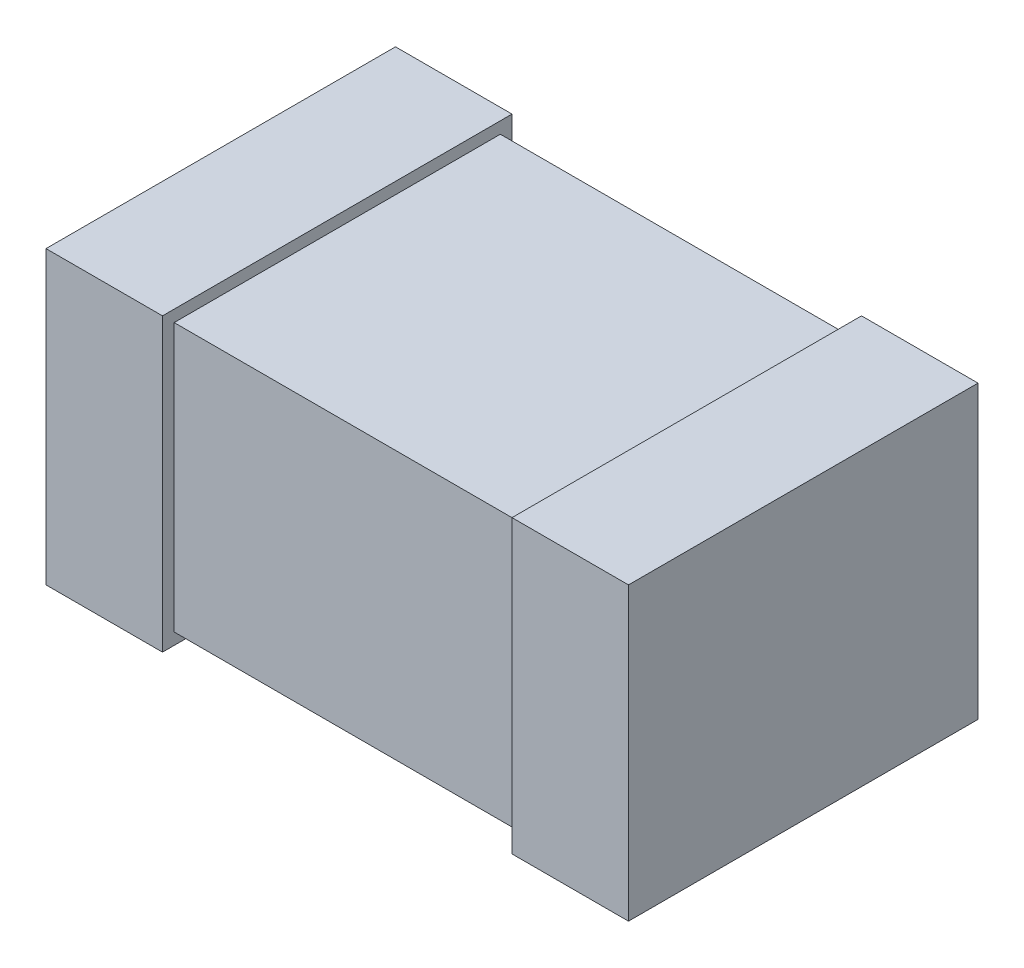
ISO-10303-21;
HEADER;
FILE_DESCRIPTION(('STEP AP214'),'2;1');
FILE_NAME('part.step','',(''),(''),'','','');
FILE_SCHEMA(('AUTOMOTIVE_DESIGN { 1 0 10303 214 1 1 1 1 }'));
ENDSEC;
DATA;
#1=APPLICATION_CONTEXT('core data for automotive mechanical design processes');
#2=APPLICATION_PROTOCOL_DEFINITION('international standard','automotive_design',2000,#1);
#3=PRODUCT_CONTEXT('',#1,'mechanical');
#4=PRODUCT('Part','Part','',(#3));
#5=PRODUCT_RELATED_PRODUCT_CATEGORY('part','',(#4));
#6=PRODUCT_DEFINITION_FORMATION('','',#4);
#7=PRODUCT_DEFINITION_CONTEXT('part definition',#1,'design');
#8=PRODUCT_DEFINITION('design','',#6,#7);
#9=PRODUCT_DEFINITION_SHAPE('','',#8);
#10=(LENGTH_UNIT() NAMED_UNIT(*) SI_UNIT(.MILLI.,.METRE.));
#11=(NAMED_UNIT(*) PLANE_ANGLE_UNIT() SI_UNIT($,.RADIAN.));
#12=(NAMED_UNIT(*) SI_UNIT($,.STERADIAN.) SOLID_ANGLE_UNIT());
#13=UNCERTAINTY_MEASURE_WITH_UNIT(LENGTH_MEASURE(1.E-05),#10,'distance_accuracy_value','');
#14=(GEOMETRIC_REPRESENTATION_CONTEXT(3) GLOBAL_UNCERTAINTY_ASSIGNED_CONTEXT((#13)) GLOBAL_UNIT_ASSIGNED_CONTEXT((#10,
#11,#12)) REPRESENTATION_CONTEXT('',''));
#15=CARTESIAN_POINT('',(0.,0.,0.));
#16=DIRECTION('',(0.,0.,1.));
#17=DIRECTION('',(1.,0.,0.));
#18=AXIS2_PLACEMENT_3D('',#15,#16,#17);
#19=CARTESIAN_POINT('',(-0.5,0.25,0.0762));
#20=DIRECTION('',(-1.,0.,0.));
#21=DIRECTION('',(0.,0.,1.));
#22=AXIS2_PLACEMENT_3D('',#19,#20,#21);
#23=PLANE('',#22);
#24=DIRECTION('',(0.,0.,1.));
#25=VECTOR('',#24,1.);
#26=CARTESIAN_POINT('',(-0.5,0.25,0.0762));
#27=LINE('',#26,#25);
#28=CARTESIAN_POINT('',(-0.5,0.25,0.0762));
#29=VERTEX_POINT('',#28);
#30=CARTESIAN_POINT('',(-0.5,0.25,0.6762));
#31=VERTEX_POINT('',#30);
#32=EDGE_CURVE('E118',#29,#31,#27,.T.);
#33=ORIENTED_EDGE('',*,*,#32,.F.);
#34=DIRECTION('',(0.,1.,0.));
#35=VECTOR('',#34,1.);
#36=CARTESIAN_POINT('',(-0.5,0.,0.0762));
#37=LINE('',#36,#35);
#38=CARTESIAN_POINT('',(-0.5,-0.25,0.0762));
#39=VERTEX_POINT('',#38);
#40=EDGE_CURVE('E20',#29,#39,#37,.F.);
#41=ORIENTED_EDGE('',*,*,#40,.T.);
#42=DIRECTION('',(0.,0.,-1.));
#43=VECTOR('',#42,1.);
#44=CARTESIAN_POINT('',(-0.5,-0.25,0.0762));
#45=LINE('',#44,#43);
#46=CARTESIAN_POINT('',(-0.5,-0.25,0.6762));
#47=VERTEX_POINT('',#46);
#48=EDGE_CURVE('E108',#47,#39,#45,.T.);
#49=ORIENTED_EDGE('',*,*,#48,.F.);
#50=DIRECTION('',(0.,1.,0.));
#51=VECTOR('',#50,1.);
#52=CARTESIAN_POINT('',(-0.5,0.,0.6762));
#53=LINE('',#52,#51);
#54=EDGE_CURVE('E103',#31,#47,#53,.F.);
#55=ORIENTED_EDGE('',*,*,#54,.F.);
#56=EDGE_LOOP('',(#33,#41,#49,#55));
#57=FACE_BOUND('',#56,.T.);
#58=ADVANCED_FACE('F17',(#57),#23,.T.);
#59=CARTESIAN_POINT('',(0.5,-0.25,0.0762));
#60=DIRECTION('',(1.,0.,0.));
#61=DIRECTION('',(0.,0.,-1.));
#62=AXIS2_PLACEMENT_3D('',#59,#60,#61);
#63=PLANE('',#62);
#64=DIRECTION('',(0.,0.,-1.));
#65=VECTOR('',#64,1.);
#66=CARTESIAN_POINT('',(0.5,-0.25,0.0762));
#67=LINE('',#66,#65);
#68=CARTESIAN_POINT('',(0.5,-0.25,0.0762));
#69=VERTEX_POINT('',#68);
#70=CARTESIAN_POINT('',(0.5,-0.25,0.6762));
#71=VERTEX_POINT('',#70);
#72=EDGE_CURVE('E136',#69,#71,#67,.F.);
#73=ORIENTED_EDGE('',*,*,#72,.F.);
#74=DIRECTION('',(0.,1.,0.));
#75=VECTOR('',#74,1.);
#76=CARTESIAN_POINT('',(0.5,0.,0.0762));
#77=LINE('',#76,#75);
#78=CARTESIAN_POINT('',(0.5,0.25,0.0762));
#79=VERTEX_POINT('',#78);
#80=EDGE_CURVE('E143',#69,#79,#77,.T.);
#81=ORIENTED_EDGE('',*,*,#80,.T.);
#82=DIRECTION('',(0.,0.,1.));
#83=VECTOR('',#82,1.);
#84=CARTESIAN_POINT('',(0.5,0.25,0.0762));
#85=LINE('',#84,#83);
#86=CARTESIAN_POINT('',(0.5,0.25,0.6762));
#87=VERTEX_POINT('',#86);
#88=EDGE_CURVE('E149',#87,#79,#85,.F.);
#89=ORIENTED_EDGE('',*,*,#88,.F.);
#90=DIRECTION('',(0.,1.,0.));
#91=VECTOR('',#90,1.);
#92=CARTESIAN_POINT('',(0.5,0.,0.6762));
#93=LINE('',#92,#91);
#94=EDGE_CURVE('E134',#71,#87,#93,.T.);
#95=ORIENTED_EDGE('',*,*,#94,.F.);
#96=EDGE_LOOP('',(#73,#81,#89,#95));
#97=FACE_BOUND('',#96,.T.);
#98=ADVANCED_FACE('F236',(#97),#63,.T.);
#99=CARTESIAN_POINT('',(0.,0.,0.0762));
#100=DIRECTION('',(0.,0.,1.));
#101=DIRECTION('',(1.,0.,0.));
#102=AXIS2_PLACEMENT_3D('',#99,#100,#101);
#103=PLANE('',#102);
#104=ORIENTED_EDGE('',*,*,#40,.F.);
#105=DIRECTION('',(1.,0.,0.));
#106=VECTOR('',#105,1.);
#107=CARTESIAN_POINT('',(0.5,0.25,0.0762));
#108=LINE('',#107,#106);
#109=CARTESIAN_POINT('',(-0.3,0.25,0.0762));
#110=VERTEX_POINT('',#109);
#111=EDGE_CURVE('E129',#110,#29,#108,.F.);
#112=ORIENTED_EDGE('',*,*,#111,.F.);
#113=DIRECTION('',(0.,1.,0.));
#114=VECTOR('',#113,1.);
#115=CARTESIAN_POINT('',(-0.3,0.25,0.0762));
#116=LINE('',#115,#114);
#117=CARTESIAN_POINT('',(-0.3,-0.25,0.0762));
#118=VERTEX_POINT('',#117);
#119=EDGE_CURVE('E124',#110,#118,#116,.F.);
#120=ORIENTED_EDGE('',*,*,#119,.T.);
#121=DIRECTION('',(1.,0.,0.));
#122=VECTOR('',#121,1.);
#123=CARTESIAN_POINT('',(-0.5,-0.25,0.0762));
#124=LINE('',#123,#122);
#125=EDGE_CURVE('E113',#39,#118,#124,.T.);
#126=ORIENTED_EDGE('',*,*,#125,.F.);
#127=EDGE_LOOP('',(#104,#112,#120,#126));
#128=FACE_BOUND('',#127,.T.);
#129=ADVANCED_FACE('F123',(#128),#103,.F.);
#130=CARTESIAN_POINT('',(-0.5,-0.25,0.0762));
#131=DIRECTION('',(0.,-1.,0.));
#132=DIRECTION('',(0.,0.,-1.));
#133=AXIS2_PLACEMENT_3D('',#130,#131,#132);
#134=PLANE('',#133);
#135=ORIENTED_EDGE('',*,*,#125,.T.);
#136=DIRECTION('',(0.,0.,1.));
#137=VECTOR('',#136,1.);
#138=CARTESIAN_POINT('',(-0.3,-0.25,0.0762));
#139=LINE('',#138,#137);
#140=CARTESIAN_POINT('',(-0.3,-0.25,0.6762));
#141=VERTEX_POINT('',#140);
#142=EDGE_CURVE('E156',#118,#141,#139,.T.);
#143=ORIENTED_EDGE('',*,*,#142,.T.);
#144=DIRECTION('',(1.,0.,0.));
#145=VECTOR('',#144,1.);
#146=CARTESIAN_POINT('',(0.,-0.25,0.6762));
#147=LINE('',#146,#145);
#148=EDGE_CURVE('E115',#47,#141,#147,.T.);
#149=ORIENTED_EDGE('',*,*,#148,.F.);
#150=ORIENTED_EDGE('',*,*,#48,.T.);
#151=EDGE_LOOP('',(#135,#143,#149,#150));
#152=FACE_BOUND('',#151,.T.);
#153=ADVANCED_FACE('F110',(#152),#134,.T.);
#154=CARTESIAN_POINT('',(0.,0.,0.6762));
#155=DIRECTION('',(0.,0.,1.));
#156=DIRECTION('',(1.,0.,0.));
#157=AXIS2_PLACEMENT_3D('',#154,#155,#156);
#158=PLANE('',#157);
#159=ORIENTED_EDGE('',*,*,#148,.T.);
#160=DIRECTION('',(0.,1.,0.));
#161=VECTOR('',#160,1.);
#162=CARTESIAN_POINT('',(-0.3,0.25,0.6762));
#163=LINE('',#162,#161);
#164=CARTESIAN_POINT('',(-0.3,0.25,0.6762));
#165=VERTEX_POINT('',#164);
#166=EDGE_CURVE('E158',#141,#165,#163,.T.);
#167=ORIENTED_EDGE('',*,*,#166,.T.);
#168=DIRECTION('',(1.,0.,0.));
#169=VECTOR('',#168,1.);
#170=CARTESIAN_POINT('',(0.5,0.25,0.6762));
#171=LINE('',#170,#169);
#172=EDGE_CURVE('E132',#31,#165,#171,.T.);
#173=ORIENTED_EDGE('',*,*,#172,.F.);
#174=ORIENTED_EDGE('',*,*,#54,.T.);
#175=EDGE_LOOP('',(#159,#167,#173,#174));
#176=FACE_BOUND('',#175,.T.);
#177=ADVANCED_FACE('F270',(#176),#158,.T.);
#178=CARTESIAN_POINT('',(0.5,0.25,0.0762));
#179=DIRECTION('',(0.,1.,0.));
#180=DIRECTION('',(0.,0.,1.));
#181=AXIS2_PLACEMENT_3D('',#178,#179,#180);
#182=PLANE('',#181);
#183=ORIENTED_EDGE('',*,*,#172,.T.);
#184=DIRECTION('',(0.,0.,1.));
#185=VECTOR('',#184,1.);
#186=CARTESIAN_POINT('',(-0.3,0.25,0.0762));
#187=LINE('',#186,#185);
#188=EDGE_CURVE('E161',#165,#110,#187,.F.);
#189=ORIENTED_EDGE('',*,*,#188,.T.);
#190=ORIENTED_EDGE('',*,*,#111,.T.);
#191=ORIENTED_EDGE('',*,*,#32,.T.);
#192=EDGE_LOOP('',(#183,#189,#190,#191));
#193=FACE_BOUND('',#192,.T.);
#194=ADVANCED_FACE('F267',(#193),#182,.T.);
#195=CARTESIAN_POINT('',(0.,0.,0.6762));
#196=DIRECTION('',(0.,0.,1.));
#197=DIRECTION('',(1.,0.,0.));
#198=AXIS2_PLACEMENT_3D('',#195,#196,#197);
#199=PLANE('',#198);
#200=DIRECTION('',(1.,0.,0.));
#201=VECTOR('',#200,1.);
#202=CARTESIAN_POINT('',(0.5,0.25,0.6762));
#203=LINE('',#202,#201);
#204=CARTESIAN_POINT('',(0.3,0.25,0.6762));
#205=VERTEX_POINT('',#204);
#206=EDGE_CURVE('E146',#205,#87,#203,.T.);
#207=ORIENTED_EDGE('',*,*,#206,.F.);
#208=DIRECTION('',(0.,1.,0.));
#209=VECTOR('',#208,1.);
#210=CARTESIAN_POINT('',(0.3,0.23,0.6762));
#211=LINE('',#210,#209);
#212=CARTESIAN_POINT('',(0.3,-0.25,0.6762));
#213=VERTEX_POINT('',#212);
#214=EDGE_CURVE('E174',#205,#213,#211,.F.);
#215=ORIENTED_EDGE('',*,*,#214,.T.);
#216=DIRECTION('',(1.,0.,0.));
#217=VECTOR('',#216,1.);
#218=CARTESIAN_POINT('',(-0.5,-0.25,0.6762));
#219=LINE('',#218,#217);
#220=EDGE_CURVE('E138',#71,#213,#219,.F.);
#221=ORIENTED_EDGE('',*,*,#220,.F.);
#222=ORIENTED_EDGE('',*,*,#94,.T.);
#223=EDGE_LOOP('',(#207,#215,#221,#222));
#224=FACE_BOUND('',#223,.T.);
#225=ADVANCED_FACE('F229',(#224),#199,.T.);
#226=CARTESIAN_POINT('',(-0.5,-0.25,0.0762));
#227=DIRECTION('',(0.,-1.,0.));
#228=DIRECTION('',(0.,0.,-1.));
#229=AXIS2_PLACEMENT_3D('',#226,#227,#228);
#230=PLANE('',#229);
#231=ORIENTED_EDGE('',*,*,#220,.T.);
#232=DIRECTION('',(0.,0.,-1.));
#233=VECTOR('',#232,1.);
#234=CARTESIAN_POINT('',(0.3,-0.25,0.0762));
#235=LINE('',#234,#233);
#236=CARTESIAN_POINT('',(0.3,-0.25,0.0762));
#237=VERTEX_POINT('',#236);
#238=EDGE_CURVE('E177',#213,#237,#235,.T.);
#239=ORIENTED_EDGE('',*,*,#238,.T.);
#240=DIRECTION('',(1.,0.,0.));
#241=VECTOR('',#240,1.);
#242=CARTESIAN_POINT('',(0.,-0.25,0.0762));
#243=LINE('',#242,#241);
#244=EDGE_CURVE('E140',#237,#69,#243,.T.);
#245=ORIENTED_EDGE('',*,*,#244,.T.);
#246=ORIENTED_EDGE('',*,*,#72,.T.);
#247=EDGE_LOOP('',(#231,#239,#245,#246));
#248=FACE_BOUND('',#247,.T.);
#249=ADVANCED_FACE('F224',(#248),#230,.T.);
#250=CARTESIAN_POINT('',(0.,0.,0.0762));
#251=DIRECTION('',(0.,0.,1.));
#252=DIRECTION('',(1.,0.,0.));
#253=AXIS2_PLACEMENT_3D('',#250,#251,#252);
#254=PLANE('',#253);
#255=ORIENTED_EDGE('',*,*,#80,.F.);
#256=ORIENTED_EDGE('',*,*,#244,.F.);
#257=DIRECTION('',(0.,1.,0.));
#258=VECTOR('',#257,1.);
#259=CARTESIAN_POINT('',(0.3,0.23,0.0762));
#260=LINE('',#259,#258);
#261=CARTESIAN_POINT('',(0.3,0.25,0.0762));
#262=VERTEX_POINT('',#261);
#263=EDGE_CURVE('E180',#237,#262,#260,.T.);
#264=ORIENTED_EDGE('',*,*,#263,.T.);
#265=DIRECTION('',(1.,0.,0.));
#266=VECTOR('',#265,1.);
#267=CARTESIAN_POINT('',(0.5,0.25,0.0762));
#268=LINE('',#267,#266);
#269=EDGE_CURVE('E151',#79,#262,#268,.F.);
#270=ORIENTED_EDGE('',*,*,#269,.F.);
#271=EDGE_LOOP('',(#255,#256,#264,#270));
#272=FACE_BOUND('',#271,.T.);
#273=ADVANCED_FACE('F234',(#272),#254,.F.);
#274=CARTESIAN_POINT('',(0.5,0.25,0.0762));
#275=DIRECTION('',(0.,1.,0.));
#276=DIRECTION('',(0.,0.,1.));
#277=AXIS2_PLACEMENT_3D('',#274,#275,#276);
#278=PLANE('',#277);
#279=ORIENTED_EDGE('',*,*,#269,.T.);
#280=DIRECTION('',(0.,0.,-1.));
#281=VECTOR('',#280,1.);
#282=CARTESIAN_POINT('',(0.3,0.25,0.0762));
#283=LINE('',#282,#281);
#284=EDGE_CURVE('E183',#262,#205,#283,.F.);
#285=ORIENTED_EDGE('',*,*,#284,.T.);
#286=ORIENTED_EDGE('',*,*,#206,.T.);
#287=ORIENTED_EDGE('',*,*,#88,.T.);
#288=EDGE_LOOP('',(#279,#285,#286,#287));
#289=FACE_BOUND('',#288,.T.);
#290=ADVANCED_FACE('F232',(#289),#278,.T.);
#291=CARTESIAN_POINT('',(0.3,-0.23,0.0762));
#292=DIRECTION('',(0.,1.,0.));
#293=DIRECTION('',(0.,0.,1.));
#294=AXIS2_PLACEMENT_3D('',#291,#292,#293);
#295=PLANE('',#294);
#296=DIRECTION('',(1.,0.,0.));
#297=VECTOR('',#296,1.);
#298=CARTESIAN_POINT('',(-0.3,-0.23,0.0962));
#299=LINE('',#298,#297);
#300=CARTESIAN_POINT('',(-0.3,-0.23,0.0962));
#301=VERTEX_POINT('',#300);
#302=CARTESIAN_POINT('',(0.3,-0.23,0.0962));
#303=VERTEX_POINT('',#302);
#304=EDGE_CURVE('E172',#301,#303,#299,.T.);
#305=ORIENTED_EDGE('',*,*,#304,.T.);
#306=DIRECTION('',(0.,0.,-1.));
#307=VECTOR('',#306,1.);
#308=CARTESIAN_POINT('',(0.3,-0.23,0.0762));
#309=LINE('',#308,#307);
#310=CARTESIAN_POINT('',(0.3,-0.23,0.6562));
#311=VERTEX_POINT('',#310);
#312=EDGE_CURVE('E187',#303,#311,#309,.F.);
#313=ORIENTED_EDGE('',*,*,#312,.T.);
#314=DIRECTION('',(-1.,0.,0.));
#315=VECTOR('',#314,1.);
#316=CARTESIAN_POINT('',(0.3,-0.23,0.6562));
#317=LINE('',#316,#315);
#318=CARTESIAN_POINT('',(-0.3,-0.23,0.6562));
#319=VERTEX_POINT('',#318);
#320=EDGE_CURVE('E153',#311,#319,#317,.T.);
#321=ORIENTED_EDGE('',*,*,#320,.T.);
#322=DIRECTION('',(0.,0.,1.));
#323=VECTOR('',#322,1.);
#324=CARTESIAN_POINT('',(-0.3,-0.23,0.0762));
#325=LINE('',#324,#323);
#326=EDGE_CURVE('E167',#319,#301,#325,.F.);
#327=ORIENTED_EDGE('',*,*,#326,.T.);
#328=EDGE_LOOP('',(#305,#313,#321,#327));
#329=FACE_BOUND('',#328,.T.);
#330=ADVANCED_FACE('F255',(#329),#295,.F.);
#331=CARTESIAN_POINT('',(0.3,0.25,0.6562));
#332=DIRECTION('',(0.,0.,-1.));
#333=DIRECTION('',(-1.,0.,0.));
#334=AXIS2_PLACEMENT_3D('',#331,#332,#333);
#335=PLANE('',#334);
#336=ORIENTED_EDGE('',*,*,#320,.F.);
#337=DIRECTION('',(0.,1.,0.));
#338=VECTOR('',#337,1.);
#339=CARTESIAN_POINT('',(0.3,0.23,0.6562));
#340=LINE('',#339,#338);
#341=CARTESIAN_POINT('',(0.3,0.23,0.6562));
#342=VERTEX_POINT('',#341);
#343=EDGE_CURVE('E190',#311,#342,#340,.T.);
#344=ORIENTED_EDGE('',*,*,#343,.T.);
#345=DIRECTION('',(1.,0.,0.));
#346=VECTOR('',#345,1.);
#347=CARTESIAN_POINT('',(-0.3,0.23,0.6562));
#348=LINE('',#347,#346);
#349=CARTESIAN_POINT('',(-0.3,0.23,0.6562));
#350=VERTEX_POINT('',#349);
#351=EDGE_CURVE('E193',#342,#350,#348,.F.);
#352=ORIENTED_EDGE('',*,*,#351,.T.);
#353=DIRECTION('',(0.,1.,0.));
#354=VECTOR('',#353,1.);
#355=CARTESIAN_POINT('',(-0.3,0.25,0.6562));
#356=LINE('',#355,#354);
#357=EDGE_CURVE('E164',#350,#319,#356,.F.);
#358=ORIENTED_EDGE('',*,*,#357,.T.);
#359=EDGE_LOOP('',(#336,#344,#352,#358));
#360=FACE_BOUND('',#359,.T.);
#361=ADVANCED_FACE('F212',(#360),#335,.F.);
#362=CARTESIAN_POINT('',(-0.3,0.25,0.0762));
#363=DIRECTION('',(-1.,0.,0.));
#364=DIRECTION('',(0.,0.,1.));
#365=AXIS2_PLACEMENT_3D('',#362,#363,#364);
#366=PLANE('',#365);
#367=DIRECTION('',(0.,1.,0.));
#368=VECTOR('',#367,1.);
#369=CARTESIAN_POINT('',(-0.3,0.25,0.0962));
#370=LINE('',#369,#368);
#371=CARTESIAN_POINT('',(-0.3,0.23,0.0962));
#372=VERTEX_POINT('',#371);
#373=EDGE_CURVE('E169',#372,#301,#370,.F.);
#374=ORIENTED_EDGE('',*,*,#373,.T.);
#375=ORIENTED_EDGE('',*,*,#326,.F.);
#376=ORIENTED_EDGE('',*,*,#357,.F.);
#377=DIRECTION('',(0.,0.,-1.));
#378=VECTOR('',#377,1.);
#379=CARTESIAN_POINT('',(-0.3,0.23,0.0762));
#380=LINE('',#379,#378);
#381=EDGE_CURVE('E196',#350,#372,#380,.T.);
#382=ORIENTED_EDGE('',*,*,#381,.T.);
#383=EDGE_LOOP('',(#374,#375,#376,#382));
#384=FACE_BOUND('',#383,.T.);
#385=ORIENTED_EDGE('',*,*,#166,.F.);
#386=ORIENTED_EDGE('',*,*,#142,.F.);
#387=ORIENTED_EDGE('',*,*,#119,.F.);
#388=ORIENTED_EDGE('',*,*,#188,.F.);
#389=EDGE_LOOP('',(#385,#386,#387,#388));
#390=FACE_BOUND('',#389,.T.);
#391=ADVANCED_FACE('F208',(#384,#390),#366,.F.);
#392=CARTESIAN_POINT('',(-0.3,0.25,0.0962));
#393=DIRECTION('',(0.,0.,1.));
#394=DIRECTION('',(1.,0.,0.));
#395=AXIS2_PLACEMENT_3D('',#392,#393,#394);
#396=PLANE('',#395);
#397=ORIENTED_EDGE('',*,*,#304,.F.);
#398=ORIENTED_EDGE('',*,*,#373,.F.);
#399=DIRECTION('',(1.,0.,0.));
#400=VECTOR('',#399,1.);
#401=CARTESIAN_POINT('',(-0.3,0.23,0.0962));
#402=LINE('',#401,#400);
#403=CARTESIAN_POINT('',(0.3,0.23,0.0962));
#404=VERTEX_POINT('',#403);
#405=EDGE_CURVE('E26',#372,#404,#402,.T.);
#406=ORIENTED_EDGE('',*,*,#405,.T.);
#407=DIRECTION('',(0.,1.,0.));
#408=VECTOR('',#407,1.);
#409=CARTESIAN_POINT('',(0.3,0.23,0.0962));
#410=LINE('',#409,#408);
#411=EDGE_CURVE('E34',#404,#303,#410,.F.);
#412=ORIENTED_EDGE('',*,*,#411,.T.);
#413=EDGE_LOOP('',(#397,#398,#406,#412));
#414=FACE_BOUND('',#413,.T.);
#415=ADVANCED_FACE('F203',(#414),#396,.F.);
#416=CARTESIAN_POINT('',(0.3,0.23,0.0762));
#417=DIRECTION('',(1.,0.,0.));
#418=DIRECTION('',(0.,0.,-1.));
#419=AXIS2_PLACEMENT_3D('',#416,#417,#418);
#420=PLANE('',#419);
#421=ORIENTED_EDGE('',*,*,#343,.F.);
#422=ORIENTED_EDGE('',*,*,#312,.F.);
#423=ORIENTED_EDGE('',*,*,#411,.F.);
#424=DIRECTION('',(0.,0.,-1.));
#425=VECTOR('',#424,1.);
#426=CARTESIAN_POINT('',(0.3,0.23,0.0762));
#427=LINE('',#426,#425);
#428=EDGE_CURVE('E11',#404,#342,#427,.F.);
#429=ORIENTED_EDGE('',*,*,#428,.T.);
#430=EDGE_LOOP('',(#421,#422,#423,#429));
#431=FACE_BOUND('',#430,.T.);
#432=ORIENTED_EDGE('',*,*,#263,.F.);
#433=ORIENTED_EDGE('',*,*,#238,.F.);
#434=ORIENTED_EDGE('',*,*,#214,.F.);
#435=ORIENTED_EDGE('',*,*,#284,.F.);
#436=EDGE_LOOP('',(#432,#433,#434,#435));
#437=FACE_BOUND('',#436,.T.);
#438=ADVANCED_FACE('F214',(#431,#437),#420,.F.);
#439=CARTESIAN_POINT('',(-0.3,0.23,0.0762));
#440=DIRECTION('',(0.,-1.,0.));
#441=DIRECTION('',(0.,0.,-1.));
#442=AXIS2_PLACEMENT_3D('',#439,#440,#441);
#443=PLANE('',#442);
#444=ORIENTED_EDGE('',*,*,#405,.F.);
#445=ORIENTED_EDGE('',*,*,#381,.F.);
#446=ORIENTED_EDGE('',*,*,#351,.F.);
#447=ORIENTED_EDGE('',*,*,#428,.F.);
#448=EDGE_LOOP('',(#444,#445,#446,#447));
#449=FACE_BOUND('',#448,.T.);
#450=ADVANCED_FACE('F206',(#449),#443,.F.);
#451=CLOSED_SHELL('',(#58,#98,#129,#153,#177,#194,#225,#249,#273,#290,#330,#361,#391,#415,#438,#450));
#452=MANIFOLD_SOLID_BREP('B1',#451);
#453=ADVANCED_BREP_SHAPE_REPRESENTATION('',(#18,#452),#14);
#454=SHAPE_DEFINITION_REPRESENTATION(#9,#453);
ENDSEC;
END-ISO-10303-21;
